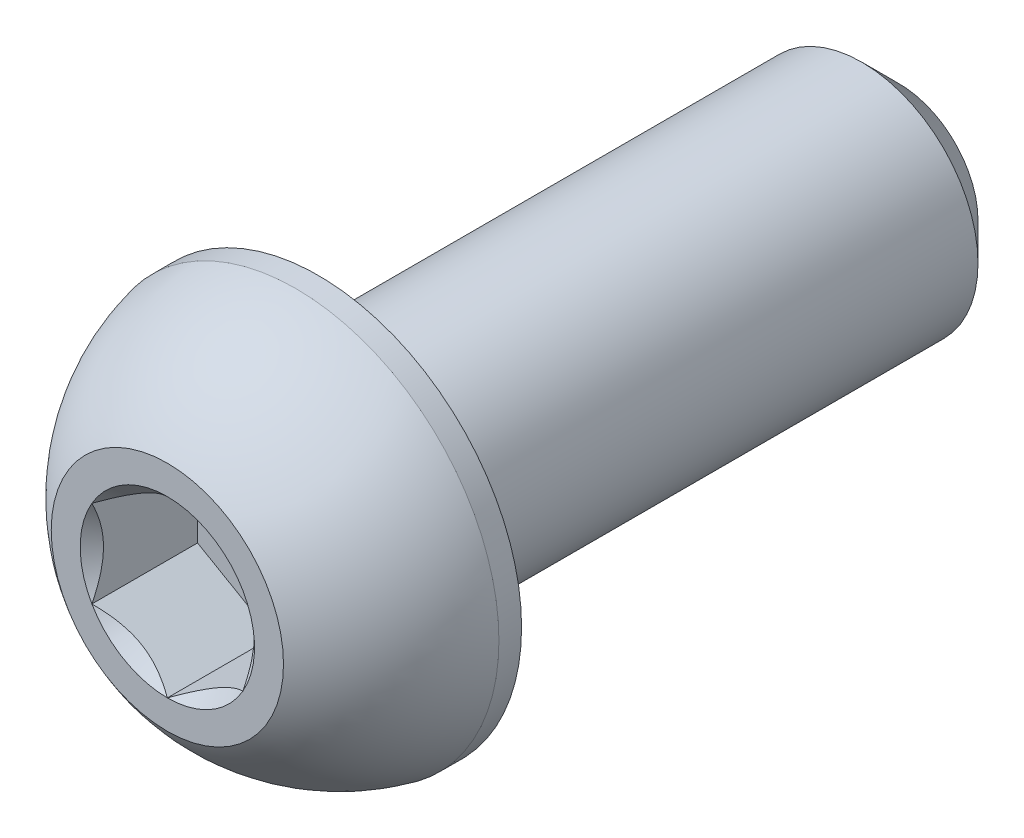
ISO-10303-21;
HEADER;
FILE_DESCRIPTION(('STEP AP214'),'2;1');
FILE_NAME('part.step','',(''),(''),'','','');
FILE_SCHEMA(('AUTOMOTIVE_DESIGN { 1 0 10303 214 1 1 1 1 }'));
ENDSEC;
DATA;
#1=APPLICATION_CONTEXT('core data for automotive mechanical design processes');
#2=APPLICATION_PROTOCOL_DEFINITION('international standard','automotive_design',2000,#1);
#3=PRODUCT_CONTEXT('',#1,'mechanical');
#4=PRODUCT('Part','Part','',(#3));
#5=PRODUCT_RELATED_PRODUCT_CATEGORY('part','',(#4));
#6=PRODUCT_DEFINITION_FORMATION('','',#4);
#7=PRODUCT_DEFINITION_CONTEXT('part definition',#1,'design');
#8=PRODUCT_DEFINITION('design','',#6,#7);
#9=PRODUCT_DEFINITION_SHAPE('','',#8);
#10=(LENGTH_UNIT() NAMED_UNIT(*) SI_UNIT(.MILLI.,.METRE.));
#11=(NAMED_UNIT(*) PLANE_ANGLE_UNIT() SI_UNIT($,.RADIAN.));
#12=(NAMED_UNIT(*) SI_UNIT($,.STERADIAN.) SOLID_ANGLE_UNIT());
#13=UNCERTAINTY_MEASURE_WITH_UNIT(LENGTH_MEASURE(1.E-05),#10,'distance_accuracy_value','');
#14=(GEOMETRIC_REPRESENTATION_CONTEXT(3) GLOBAL_UNCERTAINTY_ASSIGNED_CONTEXT((#13)) GLOBAL_UNIT_ASSIGNED_CONTEXT((#10,
#11,#12)) REPRESENTATION_CONTEXT('',''));
#15=CARTESIAN_POINT('',(0.,0.,0.));
#16=DIRECTION('',(0.,0.,1.));
#17=DIRECTION('',(1.,0.,0.));
#18=AXIS2_PLACEMENT_3D('',#15,#16,#17);
#19=CARTESIAN_POINT('',(0.,0.,3.15));
#20=DIRECTION('',(0.,0.,-1.));
#21=DIRECTION('',(-1.,0.,0.));
#22=AXIS2_PLACEMENT_3D('',#19,#20,#21);
#23=PLANE('',#22);
#24=CARTESIAN_POINT('',(0.,0.,3.15));
#25=DIRECTION('',(0.,0.,1.));
#26=DIRECTION('',(1.,0.,0.));
#27=AXIS2_PLACEMENT_3D('',#24,#25,#26);
#28=CIRCLE('',#27,0.750555349946514);
#29=CARTESIAN_POINT('',(-0.65,0.375277674973257,3.15));
#30=VERTEX_POINT('',#29);
#31=CARTESIAN_POINT('',(-0.65,-0.375277674973257,3.15));
#32=VERTEX_POINT('',#31);
#33=EDGE_CURVE('E140',#30,#32,#28,.T.);
#34=ORIENTED_EDGE('',*,*,#33,.F.);
#35=CARTESIAN_POINT('',(0.,0.750555349946514,3.15));
#36=VERTEX_POINT('',#35);
#37=EDGE_CURVE('E110',#36,#30,#28,.T.);
#38=ORIENTED_EDGE('',*,*,#37,.F.);
#39=CARTESIAN_POINT('',(0.65,0.375277674973257,3.15));
#40=VERTEX_POINT('',#39);
#41=EDGE_CURVE('E100',#40,#36,#28,.T.);
#42=ORIENTED_EDGE('',*,*,#41,.F.);
#43=CARTESIAN_POINT('',(0.65,-0.375277674973256,3.15));
#44=VERTEX_POINT('',#43);
#45=EDGE_CURVE('E61',#44,#40,#28,.T.);
#46=ORIENTED_EDGE('',*,*,#45,.F.);
#47=CARTESIAN_POINT('',(0.,-0.750555349946513,3.15));
#48=VERTEX_POINT('',#47);
#49=EDGE_CURVE('E68',#48,#44,#28,.T.);
#50=ORIENTED_EDGE('',*,*,#49,.F.);
#51=EDGE_CURVE('E143',#32,#48,#28,.T.);
#52=ORIENTED_EDGE('',*,*,#51,.F.);
#53=EDGE_LOOP('',(#34,#38,#42,#46,#50,#52));
#54=FACE_BOUND('',#53,.T.);
#55=CARTESIAN_POINT('',(0.,0.,3.15));
#56=DIRECTION('',(0.,0.,1.));
#57=DIRECTION('',(1.,0.,0.));
#58=AXIS2_PLACEMENT_3D('',#55,#56,#57);
#59=CIRCLE('',#58,0.999999999999999);
#60=CARTESIAN_POINT('',(0.,1.,3.15));
#61=VERTEX_POINT('',#60);
#62=EDGE_CURVE('E55',#61,#61,#59,.T.);
#63=ORIENTED_EDGE('',*,*,#62,.T.);
#64=EDGE_LOOP('',(#63));
#65=FACE_BOUND('',#64,.T.);
#66=ADVANCED_FACE('F41',(#54,#65),#23,.F.);
#67=CARTESIAN_POINT('',(0.,0.,1.66424208144796));
#68=DIRECTION('',(0.,0.,1.));
#69=DIRECTION('',(0.,1.,0.));
#70=AXIS2_PLACEMENT_3D('',#67,#68,#69);
#71=SPHERICAL_SURFACE('',#70,1.790942933915);
#72=CARTESIAN_POINT('',(0.,0.,2.045));
#73=DIRECTION('',(0.,0.,1.));
#74=DIRECTION('',(1.,0.,0.));
#75=AXIS2_PLACEMENT_3D('',#72,#73,#74);
#76=CIRCLE('',#75,1.75);
#77=CARTESIAN_POINT('',(0.,1.75,2.045));
#78=VERTEX_POINT('',#77);
#79=EDGE_CURVE('E241',#78,#78,#76,.T.);
#80=CARTESIAN_POINT('',(0.,1.,3.15));
#81=CARTESIAN_POINT('',(0.,1.01182643004196,3.1420401786267));
#82=CARTESIAN_POINT('',(0.,1.02355778185812,3.13393909660818));
#83=CARTESIAN_POINT('',(0.,1.04682372823726,3.11745915548289));
#84=CARTESIAN_POINT('',(0.,1.05835832280024,3.10908029637612));
#85=CARTESIAN_POINT('',(0.,1.08122415387148,3.09204954527651));
#86=CARTESIAN_POINT('',(0.,1.09255539037974,3.08339765328368));
#87=CARTESIAN_POINT('',(0.,1.11500805055768,3.06582577873956));
#88=CARTESIAN_POINT('',(0.,1.12612947422737,3.05690579618827));
#89=CARTESIAN_POINT('',(0.,1.14815616552583,3.03880282434977));
#90=CARTESIAN_POINT('',(0.,1.15906143315459,3.02961983506255));
#91=CARTESIAN_POINT('',(0.,1.18064959458057,3.01099608658973));
#92=CARTESIAN_POINT('',(0.,1.1913324883778,3.00155532740413));
#93=CARTESIAN_POINT('',(0.,1.21246981057064,2.98242142213754));
#94=CARTESIAN_POINT('',(0.,1.22292423896625,2.97272827605655));
#95=CARTESIAN_POINT('',(0.,1.24359866921302,2.95309512413341));
#96=CARTESIAN_POINT('',(0.,1.25381867106419,2.94315511829126));
#97=CARTESIAN_POINT('',(0.,1.2740184207091,2.92303391468225));
#98=CARTESIAN_POINT('',(0.,1.28399816850285,2.9128527169154));
#99=CARTESIAN_POINT('',(0.,1.30371171952532,2.89225493483821));
#100=CARTESIAN_POINT('',(0.,1.31344552275404,2.88183835052787));
#101=CARTESIAN_POINT('',(0.,1.33266163437492,2.86077573495947));
#102=CARTESIAN_POINT('',(0.,1.34214394276706,2.85012970370141));
#103=CARTESIAN_POINT('',(0.,1.36085165784782,2.82861426466644));
#104=CARTESIAN_POINT('',(0.,1.37007706453643,2.81774485688953));
#105=CARTESIAN_POINT('',(0.,1.38826571582979,2.79578886261602));
#106=CARTESIAN_POINT('',(0.,1.39722896043454,2.78470227611943));
#107=CARTESIAN_POINT('',(0.,1.41488817666623,2.76231824604234));
#108=CARTESIAN_POINT('',(0.,1.42358414829318,2.75102080246185));
#109=CARTESIAN_POINT('',(0.,1.44070386007592,2.72822150008468));
#110=CARTESIAN_POINT('',(0.,1.44912760023172,2.716719641288));
#111=CARTESIAN_POINT('',(0.,1.46569804580677,2.69351806690492));
#112=CARTESIAN_POINT('',(0.,1.47384475122603,2.68181835131851));
#113=CARTESIAN_POINT('',(0.,1.48985648202944,2.65822773460149));
#114=CARTESIAN_POINT('',(0.,1.49772150741358,2.64633683347089));
#115=CARTESIAN_POINT('',(0.,1.51316539346376,2.62237062592612));
#116=CARTESIAN_POINT('',(0.,1.5207442541298,2.61029531951197));
#117=CARTESIAN_POINT('',(0.,1.53561148923355,2.58596718680969));
#118=CARTESIAN_POINT('',(0.,1.54289986367127,2.57371436052158));
#119=CARTESIAN_POINT('',(0.,1.5571819704451,2.54903817470386));
#120=CARTESIAN_POINT('',(0.,1.56417570278122,2.53661481517425));
#121=CARTESIAN_POINT('',(0.,1.57786453748518,2.51160464674505));
#122=CARTESIAN_POINT('',(0.,1.58455963985302,2.49901783784545));
#123=CARTESIAN_POINT('',(0.,1.59764739703439,2.47368794774755));
#124=CARTESIAN_POINT('',(0.,1.60404005184792,2.46094486654925));
#125=CARTESIAN_POINT('',(0.,1.61651926879161,2.43530969803253));
#126=CARTESIAN_POINT('',(0.,1.62260583092176,2.42241761071411));
#127=CARTESIAN_POINT('',(0.,1.63446939190682,2.39649178110021));
#128=CARTESIAN_POINT('',(0.,1.64024639076172,2.38345803880473));
#129=CARTESIAN_POINT('',(0.,1.65148753111412,2.35725633115103));
#130=CARTESIAN_POINT('',(0.,1.65695167261162,2.34408836579282));
#131=CARTESIAN_POINT('',(0.,1.66756398257888,2.31762572046729));
#132=CARTESIAN_POINT('',(0.,1.67271215104863,2.30433104049997));
#133=CARTESIAN_POINT('',(0.,1.68268957938988,2.27762254664633));
#134=CARTESIAN_POINT('',(0.,1.68751883926138,2.26420873276001));
#135=CARTESIAN_POINT('',(0.,1.69685569693965,2.23726961975255));
#136=CARTESIAN_POINT('',(0.,1.70136329474644,2.22374432063141));
#137=CARTESIAN_POINT('',(0.,1.71005425727009,2.196589949172));
#138=CARTESIAN_POINT('',(0.,1.71423762198697,2.18296087683374));
#139=CARTESIAN_POINT('',(0.,1.72227773581391,2.15560673101066));
#140=CARTESIAN_POINT('',(0.,1.72613448492398,2.14188165752584));
#141=CARTESIAN_POINT('',(0.,1.73351915771601,2.11434333293356));
#142=CARTESIAN_POINT('',(0.,1.73704708139798,2.1005300818261));
#143=CARTESIAN_POINT('',(0.,1.74377213155194,2.07282328805928));
#144=CARTESIAN_POINT('',(0.,1.74696925802394,2.05892974539993));
#145=CARTESIAN_POINT('',(0.,1.75,2.045));
#146=B_SPLINE_CURVE_WITH_KNOTS('',3,(#80,#81,#82,#83,#84,#85,#86,#87,#88,#89,#90,#91,#92,#93,
#94,#95,#96,#97,#98,#99,#100,#101,#102,#103,#104,#105,#106,#107,#108,#109,#110,#111,#112,#113,
#114,#115,#116,#117,#118,#119,#120,#121,#122,#123,#124,#125,#126,#127,#128,#129,#130,#131,#132,
#133,#134,#135,#136,#137,#138,#139,#140,#141,#142,#143,#144,#145),.UNSPECIFIED.,.F.,.F.,(4,2,2,
2,2,2,2,2,2,2,2,2,2,2,2,2,2,2,2,2,2,2,2,2,2,2,2,2,2,2,2,2,4),(0.,0.0427658943058261,
0.0855317886116524,0.128297682917478,0.171063577223304,0.21382947152913,0.256595365834956,
0.299361260140783,0.342127154446609,0.384893048752435,0.427658943058261,0.470424837364087,
0.513190731669913,0.555956625975739,0.598722520281565,0.641488414587391,0.684254308893217,
0.727020203199043,0.769786097504869,0.812551991810696,0.855317886116521,0.898083780422348,
0.940849674728174,0.983615569034,1.02638146333983,1.06914735764565,1.11191325195148,
1.1546791462573,1.19744504056313,1.24021093486896,1.28297682917478,1.32574272348061,
1.36850861778643),.UNSPECIFIED.);
#147=EDGE_CURVE('BSEAM248',#61,#78,#146,.T.);
#148=ORIENTED_EDGE('',*,*,#62,.F.);
#149=ORIENTED_EDGE('',*,*,#79,.T.);
#150=ORIENTED_EDGE('',*,*,#147,.T.);
#151=ORIENTED_EDGE('',*,*,#147,.F.);
#152=EDGE_LOOP('',(#148,#150,#149,#151));
#153=FACE_BOUND('',#152,.T.);
#154=ADVANCED_FACE('F248',(#153),#71,.T.);
#155=CARTESIAN_POINT('',(0.,0.,3.15));
#156=DIRECTION('',(0.,0.,1.));
#157=DIRECTION('',(1.,0.,0.));
#158=AXIS2_PLACEMENT_3D('',#155,#156,#157);
#159=CYLINDRICAL_SURFACE('',#158,1.75);
#160=ORIENTED_EDGE('',*,*,#79,.F.);
#161=EDGE_LOOP('',(#160));
#162=FACE_BOUND('',#161,.T.);
#163=CARTESIAN_POINT('',(0.,0.,1.85));
#164=DIRECTION('',(0.,0.,1.));
#165=DIRECTION('',(1.,0.,0.));
#166=AXIS2_PLACEMENT_3D('',#163,#164,#165);
#167=CIRCLE('',#166,1.75);
#168=CARTESIAN_POINT('',(1.75,0.,1.85));
#169=VERTEX_POINT('',#168);
#170=EDGE_CURVE('E237',#169,#169,#167,.T.);
#171=ORIENTED_EDGE('',*,*,#170,.T.);
#172=EDGE_LOOP('',(#171));
#173=FACE_BOUND('',#172,.T.);
#174=ADVANCED_FACE('F251',(#162,#173),#159,.T.);
#175=CARTESIAN_POINT('',(0.,0.999999999999999,1.85));
#176=DIRECTION('',(0.,0.,1.));
#177=DIRECTION('',(1.,0.,0.));
#178=AXIS2_PLACEMENT_3D('',#175,#176,#177);
#179=PLANE('',#178);
#180=ORIENTED_EDGE('',*,*,#170,.F.);
#181=EDGE_LOOP('',(#180));
#182=FACE_BOUND('',#181,.T.);
#183=CARTESIAN_POINT('',(0.,0.,1.85));
#184=DIRECTION('',(0.,0.,1.));
#185=DIRECTION('',(1.,0.,0.));
#186=AXIS2_PLACEMENT_3D('',#183,#184,#185);
#187=CIRCLE('',#186,0.999999999999998);
#188=CARTESIAN_POINT('',(0.999999999999998,0.,1.85));
#189=VERTEX_POINT('',#188);
#190=EDGE_CURVE('E233',#189,#189,#187,.T.);
#191=ORIENTED_EDGE('',*,*,#190,.T.);
#192=EDGE_LOOP('',(#191));
#193=FACE_BOUND('',#192,.T.);
#194=ADVANCED_FACE('F256',(#182,#193),#179,.F.);
#195=CARTESIAN_POINT('',(0.,0.,3.15));
#196=DIRECTION('',(0.,0.,1.));
#197=DIRECTION('',(1.,0.,0.));
#198=AXIS2_PLACEMENT_3D('',#195,#196,#197);
#199=CYLINDRICAL_SURFACE('',#198,0.999999999999999);
#200=ORIENTED_EDGE('',*,*,#190,.F.);
#201=EDGE_LOOP('',(#200));
#202=FACE_BOUND('',#201,.T.);
#203=CARTESIAN_POINT('',(0.,0.,-2.83));
#204=DIRECTION('',(0.,0.,1.));
#205=DIRECTION('',(1.,0.,0.));
#206=AXIS2_PLACEMENT_3D('',#203,#204,#205);
#207=CIRCLE('',#206,0.999999999999999);
#208=CARTESIAN_POINT('',(0.999999999999999,0.,-2.83));
#209=VERTEX_POINT('',#208);
#210=EDGE_CURVE('E229',#209,#209,#207,.T.);
#211=ORIENTED_EDGE('',*,*,#210,.T.);
#212=EDGE_LOOP('',(#211));
#213=FACE_BOUND('',#212,.T.);
#214=ADVANCED_FACE('F262',(#202,#213),#199,.T.);
#215=CARTESIAN_POINT('',(0.,0.,-3.15));
#216=DIRECTION('',(0.,0.,1.));
#217=DIRECTION('',(1.,0.,0.));
#218=AXIS2_PLACEMENT_3D('',#215,#216,#217);
#219=CONICAL_SURFACE('',#218,0.680000000000001,0.785398163397444);
#220=ORIENTED_EDGE('',*,*,#210,.F.);
#221=EDGE_LOOP('',(#220));
#222=FACE_BOUND('',#221,.T.);
#223=CARTESIAN_POINT('',(0.,0.,-3.15));
#224=DIRECTION('',(0.,0.,1.));
#225=DIRECTION('',(1.,0.,0.));
#226=AXIS2_PLACEMENT_3D('',#223,#224,#225);
#227=CIRCLE('',#226,0.680000000000001);
#228=CARTESIAN_POINT('',(0.680000000000001,0.,-3.15));
#229=VERTEX_POINT('',#228);
#230=EDGE_CURVE('E211',#229,#229,#227,.T.);
#231=ORIENTED_EDGE('',*,*,#230,.T.);
#232=EDGE_LOOP('',(#231));
#233=FACE_BOUND('',#232,.T.);
#234=ADVANCED_FACE('F268',(#222,#233),#219,.T.);
#235=CARTESIAN_POINT('',(0.,0.,-3.15));
#236=DIRECTION('',(0.,0.,1.));
#237=DIRECTION('',(1.,0.,0.));
#238=AXIS2_PLACEMENT_3D('',#235,#236,#237);
#239=PLANE('',#238);
#240=ORIENTED_EDGE('',*,*,#230,.F.);
#241=EDGE_LOOP('',(#240));
#242=FACE_BOUND('',#241,.T.);
#243=ADVANCED_FACE('F177',(#242),#239,.F.);
#244=CARTESIAN_POINT('',(0.,0.,3.15));
#245=DIRECTION('',(0.,0.,1.));
#246=DIRECTION('',(1.,0.,0.));
#247=AXIS2_PLACEMENT_3D('',#244,#245,#246);
#248=CONICAL_SURFACE('',#247,0.750555349946514,0.78539816339745);
#249=ORIENTED_EDGE('',*,*,#37,.T.);
#250=CARTESIAN_POINT('',(0.000199999999999804,0.750670820000352,3.15011549669667));
#251=CARTESIAN_POINT('',(-0.0221538754426208,0.737764803996123,3.13721736219155));
#252=CARTESIAN_POINT('',(-0.0448801205326129,0.724643800275747,3.12507515489864));
#253=CARTESIAN_POINT('',(-0.0912219846432829,0.697888312556703,3.10284224486223));
#254=CARTESIAN_POINT('',(-0.114842019040597,0.684251279339145,3.09276392481001));
#255=CARTESIAN_POINT('',(-0.162473808706857,0.656751052753347,3.07550151642338));
#256=CARTESIAN_POINT('',(-0.186473364593087,0.642894902702,3.06827395851558));
#257=CARTESIAN_POINT('',(-0.23498941024521,0.61488415068473,3.05712920200001));
#258=CARTESIAN_POINT('',(-0.259504444041882,0.600730389323029,3.05320370262187));
#259=CARTESIAN_POINT('',(-0.319384402335921,0.566158679282902,3.04822343733471));
#260=CARTESIAN_POINT('',(-0.354889192903236,0.545659978891341,3.04912448479266));
#261=CARTESIAN_POINT('',(-0.425154552317995,0.505092254718524,3.05840856131667));
#262=CARTESIAN_POINT('',(-0.459913930439303,0.485023918403324,3.06680276302966));
#263=CARTESIAN_POINT('',(-0.52095826250894,0.449779956850418,3.0870456785073));
#264=CARTESIAN_POINT('',(-0.547523861415086,0.434442301170771,3.0978384232645));
#265=CARTESIAN_POINT('',(-0.599614154899067,0.404367956205628,3.1221519314496));
#266=CARTESIAN_POINT('',(-0.625141918825036,0.38962949483116,3.13566382100729));
#267=CARTESIAN_POINT('',(-0.6502,0.375162204919419,3.15011549669667));
#268=B_SPLINE_CURVE_WITH_KNOTS('',3,(#250,#251,#252,#253,#254,#255,#256,#257,#258,#259,#260,
#261,#262,#263,#264,#265,#266,#267),.UNSPECIFIED.,.F.,.F.,(4,2,2,2,2,2,2,2,4),(0.,
0.0866236559063445,0.173752711623243,0.259496442803569,0.345023980281753,0.467267720550126,
0.589694037029337,0.687111308755481,0.784215671813666),.UNSPECIFIED.);
#269=EDGE_CURVE('E11',#36,#30,#268,.T.);
#270=ORIENTED_EDGE('',*,*,#269,.F.);
#271=EDGE_LOOP('',(#249,#270));
#272=FACE_BOUND('',#271,.T.);
#273=ADVANCED_FACE('F114',(#272),#248,.F.);
#274=ORIENTED_EDGE('',*,*,#33,.T.);
#275=CARTESIAN_POINT('',(-0.65,-0.748456856201999,3.39075069038401));
#276=CARTESIAN_POINT('',(-0.65,-0.711991073878822,3.36328028593362));
#277=CARTESIAN_POINT('',(-0.65,-0.6751396400828,3.3362651954762));
#278=CARTESIAN_POINT('',(-0.65,-0.600031183452825,3.28362934828316));
#279=CARTESIAN_POINT('',(-0.65,-0.561765441270899,3.2580211061291));
#280=CARTESIAN_POINT('',(-0.65,-0.481525479406324,3.20773749376246));
#281=CARTESIAN_POINT('',(-0.65,-0.439464253670489,3.18319880219876));
#282=CARTESIAN_POINT('',(-0.65,-0.353242719412721,3.13831465969864));
#283=CARTESIAN_POINT('',(-0.65,-0.309090130602527,3.11795507248949));
#284=CARTESIAN_POINT('',(-0.65,-0.242810057498671,3.09304872908865));
#285=CARTESIAN_POINT('',(-0.65,-0.22166734982169,3.08590072741471));
#286=CARTESIAN_POINT('',(-0.65,-0.178882845085544,3.07329752945255));
#287=CARTESIAN_POINT('',(-0.65,-0.157241013753965,3.06784244978313));
#288=CARTESIAN_POINT('',(-0.65,-0.0924732258239351,3.05466076531022));
#289=CARTESIAN_POINT('',(-0.65,-0.0486986201802782,3.04979355976944));
#290=CARTESIAN_POINT('',(-0.65,0.0373331587621232,3.04914448923078));
#291=CARTESIAN_POINT('',(-0.65,0.0795879418799261,3.05304033931981));
#292=CARTESIAN_POINT('',(-0.65,0.142230570834974,3.06449232559783));
#293=CARTESIAN_POINT('',(-0.65,0.163174856664668,3.06931456423673));
#294=CARTESIAN_POINT('',(-0.65,0.204615212735413,3.08060009995474));
#295=CARTESIAN_POINT('',(-0.65,0.225111320324616,3.08706325972014));
#296=CARTESIAN_POINT('',(-0.65,0.28963853477237,3.10984409213164));
#297=CARTESIAN_POINT('',(-0.65,0.33274820687505,3.1287572451342));
#298=CARTESIAN_POINT('',(-0.65,0.416943840013233,3.17081128188878));
#299=CARTESIAN_POINT('',(-0.65,0.458021834530769,3.19396735475778));
#300=CARTESIAN_POINT('',(-0.65,0.536529233245989,3.24172663971809));
#301=CARTESIAN_POINT('',(-0.65,0.574038509134621,3.26620075812715));
#302=CARTESIAN_POINT('',(-0.65,0.647609691485456,3.31662345601488));
#303=CARTESIAN_POINT('',(-0.65,0.683680924535919,3.34255834365529));
#304=CARTESIAN_POINT('',(-0.65,0.71935620475114,3.36896687739743));
#305=B_SPLINE_CURVE_WITH_KNOTS('',3,(#275,#276,#277,#278,#279,#280,#281,#282,#283,#284,#285,
#286,#287,#288,#289,#290,#291,#292,#293,#294,#295,#296,#297,#298,#299,#300,#301,#302,#303,#304),
.UNSPECIFIED.,.F.,.F.,(4,2,2,2,2,2,2,2,2,2,2,2,2,2,4),(0.,0.137014030009579,0.275096405762553,
0.421060359835525,0.566522128775094,0.633415056462921,0.700312591121805,0.83153492450834,
0.958010408789903,1.02242898521266,1.08684217280829,1.22766018796413,1.36899252873704,
1.50330165960873,1.63651263433843),.UNSPECIFIED.);
#306=EDGE_CURVE('E109',#30,#32,#305,.F.);
#307=ORIENTED_EDGE('',*,*,#306,.F.);
#308=EDGE_LOOP('',(#274,#307));
#309=FACE_BOUND('',#308,.T.);
#310=ADVANCED_FACE('F281',(#309),#248,.F.);
#311=ORIENTED_EDGE('',*,*,#51,.T.);
#312=CARTESIAN_POINT('',(-0.6502,-0.375162204919418,3.15011549669667));
#313=CARTESIAN_POINT('',(-0.627846124557379,-0.388068220923647,3.13721736219155));
#314=CARTESIAN_POINT('',(-0.605119879467387,-0.401189224644023,3.12507515489864));
#315=CARTESIAN_POINT('',(-0.558778015356717,-0.427944712363067,3.10284224486223));
#316=CARTESIAN_POINT('',(-0.535157980959403,-0.441581745580625,3.09276392481001));
#317=CARTESIAN_POINT('',(-0.487526191293144,-0.469081972166423,3.07550151642337));
#318=CARTESIAN_POINT('',(-0.463526635406914,-0.48293812221777,3.06827395851558));
#319=CARTESIAN_POINT('',(-0.41501058975479,-0.510948874235039,3.05712920200001));
#320=CARTESIAN_POINT('',(-0.390495555958119,-0.52510263559674,3.05320370262187));
#321=CARTESIAN_POINT('',(-0.33061559766408,-0.559674345636867,3.04822343733471));
#322=CARTESIAN_POINT('',(-0.295110807096764,-0.580173046028428,3.04912448479266));
#323=CARTESIAN_POINT('',(-0.224845447682005,-0.620740770201245,3.05840856131667));
#324=CARTESIAN_POINT('',(-0.190086069560698,-0.640809106516446,3.06680276302966));
#325=CARTESIAN_POINT('',(-0.129041737491061,-0.676053068069352,3.0870456785073));
#326=CARTESIAN_POINT('',(-0.102476138584915,-0.691390723748999,3.0978384232645));
#327=CARTESIAN_POINT('',(-0.0503858451009333,-0.721465068714142,3.1221519314496));
#328=CARTESIAN_POINT('',(-0.0248580811749643,-0.73620353008861,3.13566382100729));
#329=CARTESIAN_POINT('',(0.000199999999999939,-0.750670820000351,3.15011549669667));
#330=B_SPLINE_CURVE_WITH_KNOTS('',3,(#312,#313,#314,#315,#316,#317,#318,#319,#320,#321,#322,
#323,#324,#325,#326,#327,#328,#329),.UNSPECIFIED.,.F.,.F.,(4,2,2,2,2,2,2,2,4),(0.,
0.0866236559063444,0.173752711623243,0.259496442803569,0.345023980281753,0.467267720550126,
0.589694037029336,0.687111308755481,0.784215671813665),.UNSPECIFIED.);
#331=EDGE_CURVE('E153',#32,#48,#330,.T.);
#332=ORIENTED_EDGE('',*,*,#331,.F.);
#333=EDGE_LOOP('',(#311,#332));
#334=FACE_BOUND('',#333,.T.);
#335=ADVANCED_FACE('F298',(#334),#248,.F.);
#336=ORIENTED_EDGE('',*,*,#49,.T.);
#337=CARTESIAN_POINT('',(-0.000200000000000003,-0.750670820000351,3.15011549669667));
#338=CARTESIAN_POINT('',(0.0221538754426205,-0.737764803996122,3.13721736219155));
#339=CARTESIAN_POINT('',(0.0448801205326124,-0.724643800275746,3.12507515489864));
#340=CARTESIAN_POINT('',(0.0912219846432822,-0.697888312556702,3.10284224486223));
#341=CARTESIAN_POINT('',(0.114842019040596,-0.684251279339144,3.09276392481001));
#342=CARTESIAN_POINT('',(0.162473808706855,-0.656751052753346,3.07550151642337));
#343=CARTESIAN_POINT('',(0.186473364593086,-0.642894902702,3.06827395851558));
#344=CARTESIAN_POINT('',(0.234989410245209,-0.61488415068473,3.05712920200001));
#345=CARTESIAN_POINT('',(0.25950444404188,-0.600730389323029,3.05320370262187));
#346=CARTESIAN_POINT('',(0.319384402335919,-0.566158679282902,3.04822343733471));
#347=CARTESIAN_POINT('',(0.354889192903234,-0.545659978891342,3.04912448479266));
#348=CARTESIAN_POINT('',(0.425154552317993,-0.505092254718525,3.05840856131667));
#349=CARTESIAN_POINT('',(0.4599139304393,-0.485023918403324,3.06680276302966));
#350=CARTESIAN_POINT('',(0.520958262508938,-0.449779956850418,3.0870456785073));
#351=CARTESIAN_POINT('',(0.547523861415084,-0.434442301170771,3.0978384232645));
#352=CARTESIAN_POINT('',(0.599614154899066,-0.404367956205627,3.1221519314496));
#353=CARTESIAN_POINT('',(0.625141918825036,-0.389629494831159,3.13566382100729));
#354=CARTESIAN_POINT('',(0.6502,-0.375162204919418,3.15011549669667));
#355=B_SPLINE_CURVE_WITH_KNOTS('',3,(#337,#338,#339,#340,#341,#342,#343,#344,#345,#346,#347,
#348,#349,#350,#351,#352,#353,#354),.UNSPECIFIED.,.F.,.F.,(4,2,2,2,2,2,2,2,4),(0.,
0.0866236559063441,0.173752711623242,0.259496442803568,0.345023980281751,0.467267720550124,
0.589694037029334,0.68711130875548,0.784215671813666),.UNSPECIFIED.);
#356=EDGE_CURVE('E378',#48,#44,#355,.T.);
#357=ORIENTED_EDGE('',*,*,#356,.F.);
#358=EDGE_LOOP('',(#336,#357));
#359=FACE_BOUND('',#358,.T.);
#360=ADVANCED_FACE('F305',(#359),#248,.F.);
#361=ORIENTED_EDGE('',*,*,#45,.T.);
#362=CARTESIAN_POINT('',(0.65,-0.748456856310897,3.39075069046623));
#363=CARTESIAN_POINT('',(0.65,-0.711991073981599,3.36328028600952));
#364=CARTESIAN_POINT('',(0.65,-0.675139640179433,3.33626519554577));
#365=CARTESIAN_POINT('',(0.65,-0.600031183536872,3.28362934834011));
#366=CARTESIAN_POINT('',(0.65,-0.561765441348501,3.25802110617975));
#367=CARTESIAN_POINT('',(0.65,-0.481525479469872,3.20773749380016));
#368=CARTESIAN_POINT('',(0.65,-0.43946425372639,3.18319880222984));
#369=CARTESIAN_POINT('',(0.65,-0.353242719452679,3.13831465971746));
#370=CARTESIAN_POINT('',(0.65,-0.309090130634193,3.11795507250266));
#371=CARTESIAN_POINT('',(0.65,-0.242810057524099,3.09304872909763));
#372=CARTESIAN_POINT('',(0.65,-0.221667349849732,3.08590072742385));
#373=CARTESIAN_POINT('',(0.65,-0.178882845118893,3.07329752946149));
#374=CARTESIAN_POINT('',(0.65,-0.157241013790008,3.0678424497917));
#375=CARTESIAN_POINT('',(0.65,-0.0924732258678793,3.05466076531677));
#376=CARTESIAN_POINT('',(0.65,-0.0486986202294705,3.04979355977344));
#377=CARTESIAN_POINT('',(0.65,0.0373331587036344,3.04914448922772));
#378=CARTESIAN_POINT('',(0.65,0.0795879418173606,3.05304033931236));
#379=CARTESIAN_POINT('',(0.65,0.142230570766795,3.0644923255833));
#380=CARTESIAN_POINT('',(0.65,0.163174856594624,3.0693145642197));
#381=CARTESIAN_POINT('',(0.65,0.204615212661818,3.08060009993267));
#382=CARTESIAN_POINT('',(0.65,0.225111320249333,3.08706325969551));
#383=CARTESIAN_POINT('',(0.65,0.289638534680692,3.10984409209498));
#384=CARTESIAN_POINT('',(0.65,0.332748206769488,3.12875724508647));
#385=CARTESIAN_POINT('',(0.65,0.41694383988097,3.1708112818177));
#386=CARTESIAN_POINT('',(0.65,0.458021834385695,3.19396735467439));
#387=CARTESIAN_POINT('',(0.65,0.536529233077878,3.24172663961117));
#388=CARTESIAN_POINT('',(0.65,0.574038508956202,3.26620075800911));
#389=CARTESIAN_POINT('',(0.65,0.647609691286781,3.31662345587469));
#390=CARTESIAN_POINT('',(0.65,0.683680924327292,3.34255834350407));
#391=CARTESIAN_POINT('',(0.65,0.719356204532568,3.36896687723526));
#392=B_SPLINE_CURVE_WITH_KNOTS('',3,(#362,#363,#364,#365,#366,#367,#368,#369,#370,#371,#372,
#373,#374,#375,#376,#377,#378,#379,#380,#381,#382,#383,#384,#385,#386,#387,#388,#389,#390,#391),
.UNSPECIFIED.,.F.,.F.,(4,2,2,2,2,2,2,2,2,2,2,2,2,2,4),(0.,0.137014030035661,0.275096405815206,
0.421060359917977,0.566522128887061,0.633415056567334,0.700312591218677,0.831534924590809,
0.958010408859154,1.02242898527478,1.08684217286327,1.22766018796786,1.36899252868917,
1.50330165951672,1.63651263420287),.UNSPECIFIED.);
#393=EDGE_CURVE('E127',#44,#40,#392,.T.);
#394=ORIENTED_EDGE('',*,*,#393,.F.);
#395=EDGE_LOOP('',(#361,#394));
#396=FACE_BOUND('',#395,.T.);
#397=ADVANCED_FACE('F312',(#396),#248,.F.);
#398=ORIENTED_EDGE('',*,*,#41,.T.);
#399=CARTESIAN_POINT('',(0.6502,0.375162204919419,3.15011549669667));
#400=CARTESIAN_POINT('',(0.627846124557379,0.388068220923648,3.13721736219155));
#401=CARTESIAN_POINT('',(0.605119879467387,0.401189224644024,3.12507515489864));
#402=CARTESIAN_POINT('',(0.558778015356717,0.427944712363068,3.10284224486223));
#403=CARTESIAN_POINT('',(0.535157980959403,0.441581745580626,3.09276392481001));
#404=CARTESIAN_POINT('',(0.487526191293144,0.469081972166424,3.07550151642337));
#405=CARTESIAN_POINT('',(0.463526635406914,0.48293812221777,3.06827395851558));
#406=CARTESIAN_POINT('',(0.41501058975479,0.51094887423504,3.05712920200001));
#407=CARTESIAN_POINT('',(0.390495555958119,0.525102635596741,3.05320370262187));
#408=CARTESIAN_POINT('',(0.33061559766408,0.559674345636868,3.04822343733471));
#409=CARTESIAN_POINT('',(0.295110807096765,0.580173046028429,3.04912448479266));
#410=CARTESIAN_POINT('',(0.224845447682005,0.620740770201246,3.05840856131667));
#411=CARTESIAN_POINT('',(0.190086069560698,0.640809106516447,3.06680276302966));
#412=CARTESIAN_POINT('',(0.12904173749106,0.676053068069353,3.0870456785073));
#413=CARTESIAN_POINT('',(0.102476138584914,0.691390723749,3.0978384232645));
#414=CARTESIAN_POINT('',(0.0503858451009331,0.721465068714143,3.1221519314496));
#415=CARTESIAN_POINT('',(0.0248580811749641,0.736203530088611,3.13566382100729));
#416=CARTESIAN_POINT('',(-0.000200000000000251,0.750670820000352,3.15011549669667));
#417=B_SPLINE_CURVE_WITH_KNOTS('',3,(#399,#400,#401,#402,#403,#404,#405,#406,#407,#408,#409,
#410,#411,#412,#413,#414,#415,#416),.UNSPECIFIED.,.F.,.F.,(4,2,2,2,2,2,2,2,4),(0.,
0.0866236559063445,0.173752711623243,0.259496442803568,0.345023980281753,0.467267720550126,
0.589694037029336,0.687111308755481,0.784215671813666),.UNSPECIFIED.);
#418=EDGE_CURVE('E104',#40,#36,#417,.T.);
#419=ORIENTED_EDGE('',*,*,#418,.F.);
#420=EDGE_LOOP('',(#398,#419));
#421=FACE_BOUND('',#420,.T.);
#422=ADVANCED_FACE('F102',(#421),#248,.F.);
#423=CARTESIAN_POINT('',(0.,0.,2.24));
#424=DIRECTION('',(0.,0.,1.));
#425=DIRECTION('',(1.,0.,0.));
#426=AXIS2_PLACEMENT_3D('',#423,#424,#425);
#427=PLANE('',#426);
#428=DIRECTION('',(-0.866025403784439,0.5,0.));
#429=VECTOR('',#428,1.);
#430=CARTESIAN_POINT('',(0.65,0.375277674973257,2.24));
#431=LINE('',#430,#429);
#432=CARTESIAN_POINT('',(0.65,0.375277674973257,2.24));
#433=VERTEX_POINT('',#432);
#434=CARTESIAN_POINT('',(0.,0.750555349946514,2.24));
#435=VERTEX_POINT('',#434);
#436=EDGE_CURVE('E126',#433,#435,#431,.T.);
#437=ORIENTED_EDGE('',*,*,#436,.T.);
#438=DIRECTION('',(-0.866025403784439,-0.5,0.));
#439=VECTOR('',#438,1.);
#440=CARTESIAN_POINT('',(0.,0.750555349946514,2.24));
#441=LINE('',#440,#439);
#442=CARTESIAN_POINT('',(-0.65,0.375277674973257,2.24));
#443=VERTEX_POINT('',#442);
#444=EDGE_CURVE('E131',#435,#443,#441,.T.);
#445=ORIENTED_EDGE('',*,*,#444,.T.);
#446=DIRECTION('',(0.,-1.,0.));
#447=VECTOR('',#446,1.);
#448=CARTESIAN_POINT('',(-0.65,0.375277674973257,2.24));
#449=LINE('',#448,#447);
#450=CARTESIAN_POINT('',(-0.65,-0.375277674973256,2.24));
#451=VERTEX_POINT('',#450);
#452=EDGE_CURVE('E194',#443,#451,#449,.T.);
#453=ORIENTED_EDGE('',*,*,#452,.T.);
#454=DIRECTION('',(0.866025403784439,-0.5,0.));
#455=VECTOR('',#454,1.);
#456=CARTESIAN_POINT('',(-0.65,-0.375277674973256,2.24));
#457=LINE('',#456,#455);
#458=CARTESIAN_POINT('',(0.,-0.750555349946513,2.24));
#459=VERTEX_POINT('',#458);
#460=EDGE_CURVE('E198',#451,#459,#457,.T.);
#461=ORIENTED_EDGE('',*,*,#460,.T.);
#462=DIRECTION('',(0.866025403784439,0.5,0.));
#463=VECTOR('',#462,1.);
#464=CARTESIAN_POINT('',(0.,-0.750555349946513,2.24));
#465=LINE('',#464,#463);
#466=CARTESIAN_POINT('',(0.65,-0.375277674973256,2.24));
#467=VERTEX_POINT('',#466);
#468=EDGE_CURVE('E202',#459,#467,#465,.T.);
#469=ORIENTED_EDGE('',*,*,#468,.T.);
#470=DIRECTION('',(0.,1.,0.));
#471=VECTOR('',#470,1.);
#472=CARTESIAN_POINT('',(0.65,-0.375277674973256,2.24));
#473=LINE('',#472,#471);
#474=EDGE_CURVE('E135',#467,#433,#473,.T.);
#475=ORIENTED_EDGE('',*,*,#474,.T.);
#476=EDGE_LOOP('',(#437,#445,#453,#461,#469,#475));
#477=FACE_BOUND('',#476,.T.);
#478=ADVANCED_FACE('F172',(#477),#427,.T.);
#479=CARTESIAN_POINT('',(0.,0.750555349946514,2.24));
#480=DIRECTION('',(-0.5,0.866025403784439,0.));
#481=DIRECTION('',(-0.866025403784439,-0.5,0.));
#482=AXIS2_PLACEMENT_3D('',#479,#480,#481);
#483=PLANE('',#482);
#484=DIRECTION('',(0.,0.,1.));
#485=VECTOR('',#484,1.);
#486=CARTESIAN_POINT('',(0.,0.750555349946514,2.24));
#487=LINE('',#486,#485);
#488=EDGE_CURVE('E122',#435,#36,#487,.T.);
#489=ORIENTED_EDGE('',*,*,#488,.T.);
#490=ORIENTED_EDGE('',*,*,#269,.T.);
#491=DIRECTION('',(0.,0.,1.));
#492=VECTOR('',#491,1.);
#493=CARTESIAN_POINT('',(-0.65,0.375277674973257,2.24));
#494=LINE('',#493,#492);
#495=EDGE_CURVE('E134',#443,#30,#494,.T.);
#496=ORIENTED_EDGE('',*,*,#495,.F.);
#497=ORIENTED_EDGE('',*,*,#444,.F.);
#498=EDGE_LOOP('',(#489,#490,#496,#497));
#499=FACE_BOUND('',#498,.T.);
#500=ADVANCED_FACE('F129',(#499),#483,.F.);
#501=CARTESIAN_POINT('',(-0.65,0.375277674973257,2.24));
#502=DIRECTION('',(-1.,0.,0.));
#503=DIRECTION('',(0.,-1.,0.));
#504=AXIS2_PLACEMENT_3D('',#501,#502,#503);
#505=PLANE('',#504);
#506=ORIENTED_EDGE('',*,*,#495,.T.);
#507=ORIENTED_EDGE('',*,*,#306,.T.);
#508=DIRECTION('',(0.,0.,1.));
#509=VECTOR('',#508,1.);
#510=CARTESIAN_POINT('',(-0.65,-0.375277674973256,2.24));
#511=LINE('',#510,#509);
#512=EDGE_CURVE('E220',#451,#32,#511,.T.);
#513=ORIENTED_EDGE('',*,*,#512,.F.);
#514=ORIENTED_EDGE('',*,*,#452,.F.);
#515=EDGE_LOOP('',(#506,#507,#513,#514));
#516=FACE_BOUND('',#515,.T.);
#517=ADVANCED_FACE('F162',(#516),#505,.F.);
#518=CARTESIAN_POINT('',(-0.65,-0.375277674973256,2.24));
#519=DIRECTION('',(-0.5,-0.866025403784439,0.));
#520=DIRECTION('',(0.866025403784439,-0.5,0.));
#521=AXIS2_PLACEMENT_3D('',#518,#519,#520);
#522=PLANE('',#521);
#523=ORIENTED_EDGE('',*,*,#512,.T.);
#524=ORIENTED_EDGE('',*,*,#331,.T.);
#525=DIRECTION('',(0.,0.,1.));
#526=VECTOR('',#525,1.);
#527=CARTESIAN_POINT('',(0.,-0.750555349946513,2.24));
#528=LINE('',#527,#526);
#529=EDGE_CURVE('E216',#459,#48,#528,.T.);
#530=ORIENTED_EDGE('',*,*,#529,.F.);
#531=ORIENTED_EDGE('',*,*,#460,.F.);
#532=EDGE_LOOP('',(#523,#524,#530,#531));
#533=FACE_BOUND('',#532,.T.);
#534=ADVANCED_FACE('F165',(#533),#522,.F.);
#535=CARTESIAN_POINT('',(0.,-0.750555349946513,2.24));
#536=DIRECTION('',(0.5,-0.866025403784439,0.));
#537=DIRECTION('',(0.866025403784439,0.5,0.));
#538=AXIS2_PLACEMENT_3D('',#535,#536,#537);
#539=PLANE('',#538);
#540=ORIENTED_EDGE('',*,*,#529,.T.);
#541=ORIENTED_EDGE('',*,*,#356,.T.);
#542=DIRECTION('',(0.,0.,1.));
#543=VECTOR('',#542,1.);
#544=CARTESIAN_POINT('',(0.65,-0.375277674973256,2.24));
#545=LINE('',#544,#543);
#546=EDGE_CURVE('E212',#467,#44,#545,.T.);
#547=ORIENTED_EDGE('',*,*,#546,.F.);
#548=ORIENTED_EDGE('',*,*,#468,.F.);
#549=EDGE_LOOP('',(#540,#541,#547,#548));
#550=FACE_BOUND('',#549,.T.);
#551=ADVANCED_FACE('F336',(#550),#539,.F.);
#552=CARTESIAN_POINT('',(0.65,-0.375277674973256,2.24));
#553=DIRECTION('',(1.,0.,0.));
#554=DIRECTION('',(0.,1.,0.));
#555=AXIS2_PLACEMENT_3D('',#552,#553,#554);
#556=PLANE('',#555);
#557=ORIENTED_EDGE('',*,*,#546,.T.);
#558=ORIENTED_EDGE('',*,*,#393,.T.);
#559=DIRECTION('',(0.,0.,1.));
#560=VECTOR('',#559,1.);
#561=CARTESIAN_POINT('',(0.65,0.375277674973257,2.24));
#562=LINE('',#561,#560);
#563=EDGE_CURVE('E124',#433,#40,#562,.T.);
#564=ORIENTED_EDGE('',*,*,#563,.F.);
#565=ORIENTED_EDGE('',*,*,#474,.F.);
#566=EDGE_LOOP('',(#557,#558,#564,#565));
#567=FACE_BOUND('',#566,.T.);
#568=ADVANCED_FACE('F176',(#567),#556,.F.);
#569=CARTESIAN_POINT('',(0.65,0.375277674973257,2.24));
#570=DIRECTION('',(0.5,0.866025403784439,0.));
#571=DIRECTION('',(-0.866025403784439,0.5,0.));
#572=AXIS2_PLACEMENT_3D('',#569,#570,#571);
#573=PLANE('',#572);
#574=ORIENTED_EDGE('',*,*,#563,.T.);
#575=ORIENTED_EDGE('',*,*,#418,.T.);
#576=ORIENTED_EDGE('',*,*,#488,.F.);
#577=ORIENTED_EDGE('',*,*,#436,.F.);
#578=EDGE_LOOP('',(#574,#575,#576,#577));
#579=FACE_BOUND('',#578,.T.);
#580=ADVANCED_FACE('F120',(#579),#573,.F.);
#581=CLOSED_SHELL('',(#66,#154,#174,#194,#214,#234,#243,#273,#310,#335,#360,#397,#422,#478,#500,
#517,#534,#551,#568,#580));
#582=MANIFOLD_SOLID_BREP('B2',#581);
#583=ADVANCED_BREP_SHAPE_REPRESENTATION('',(#18,#582),#14);
#584=SHAPE_DEFINITION_REPRESENTATION(#9,#583);
ENDSEC;
END-ISO-10303-21;
